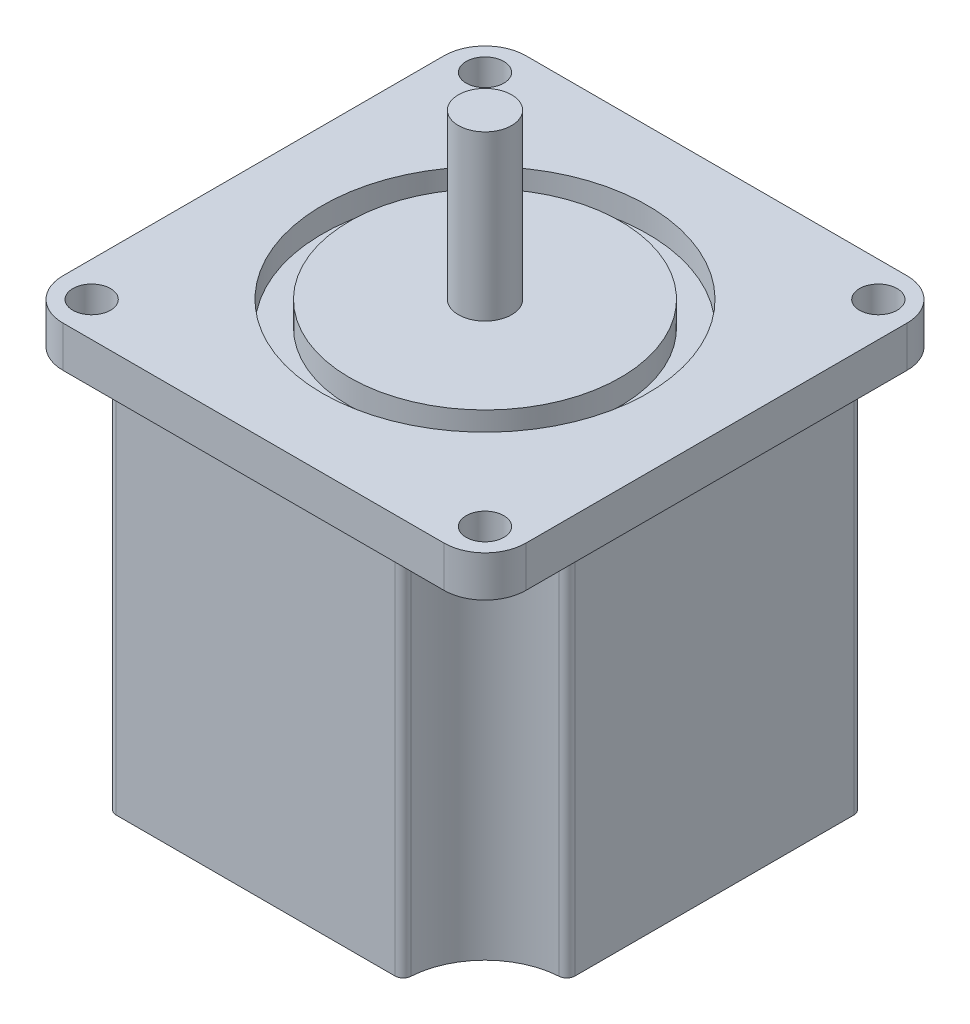
ISO-10303-21;
HEADER;
FILE_DESCRIPTION(('STEP AP214'),'2;1');
FILE_NAME('part.step','',(''),(''),'','','');
FILE_SCHEMA(('AUTOMOTIVE_DESIGN { 1 0 10303 214 1 1 1 1 }'));
ENDSEC;
DATA;
#1=APPLICATION_CONTEXT('core data for automotive mechanical design processes');
#2=APPLICATION_PROTOCOL_DEFINITION('international standard','automotive_design',2000,#1);
#3=PRODUCT_CONTEXT('',#1,'mechanical');
#4=PRODUCT('Part','Part','',(#3));
#5=PRODUCT_RELATED_PRODUCT_CATEGORY('part','',(#4));
#6=PRODUCT_DEFINITION_FORMATION('','',#4);
#7=PRODUCT_DEFINITION_CONTEXT('part definition',#1,'design');
#8=PRODUCT_DEFINITION('design','',#6,#7);
#9=PRODUCT_DEFINITION_SHAPE('','',#8);
#10=(LENGTH_UNIT() NAMED_UNIT(*) SI_UNIT(.MILLI.,.METRE.));
#11=(NAMED_UNIT(*) PLANE_ANGLE_UNIT() SI_UNIT($,.RADIAN.));
#12=(NAMED_UNIT(*) SI_UNIT($,.STERADIAN.) SOLID_ANGLE_UNIT());
#13=UNCERTAINTY_MEASURE_WITH_UNIT(LENGTH_MEASURE(1.E-05),#10,'distance_accuracy_value','');
#14=(GEOMETRIC_REPRESENTATION_CONTEXT(3) GLOBAL_UNCERTAINTY_ASSIGNED_CONTEXT((#13)) GLOBAL_UNIT_ASSIGNED_CONTEXT((#10,
#11,#12)) REPRESENTATION_CONTEXT('',''));
#15=CARTESIAN_POINT('',(0.,0.,0.));
#16=DIRECTION('',(0.,0.,1.));
#17=DIRECTION('',(1.,0.,0.));
#18=AXIS2_PLACEMENT_3D('',#15,#16,#17);
#19=CARTESIAN_POINT('',(0.,0.,0.));
#20=DIRECTION('',(0.,1.,0.));
#21=DIRECTION('',(0.,0.,1.));
#22=AXIS2_PLACEMENT_3D('',#19,#20,#21);
#23=PLANE('',#22);
#24=CARTESIAN_POINT('',(-27.6799104985517,0.,-27.6799104985517));
#25=DIRECTION('',(0.,1.,0.));
#26=DIRECTION('',(0.,0.,1.));
#27=AXIS2_PLACEMENT_3D('',#24,#25,#26);
#28=CIRCLE('',#27,9.68520131690144);
#29=CARTESIAN_POINT('',(-27.0636310424471,0.,-18.0143363210446));
#30=VERTEX_POINT('',#29);
#31=CARTESIAN_POINT('',(-18.0143363210446,0.,-27.0636310424471));
#32=VERTEX_POINT('',#31);
#33=EDGE_CURVE('E204',#30,#32,#28,.T.);
#34=ORIENTED_EDGE('',*,*,#33,.T.);
#35=CARTESIAN_POINT('',(-17.0163628291937,0.,-27.));
#36=DIRECTION('',(0.,1.,0.));
#37=DIRECTION('',(0.,0.,1.));
#38=AXIS2_PLACEMENT_3D('',#35,#36,#37);
#39=CIRCLE('',#38,1.);
#40=CARTESIAN_POINT('',(-17.0163628291937,0.,-28.));
#41=VERTEX_POINT('',#40);
#42=EDGE_CURVE('E248',#32,#41,#39,.F.);
#43=ORIENTED_EDGE('',*,*,#42,.T.);
#44=DIRECTION('',(-1.,0.,0.));
#45=VECTOR('',#44,1.);
#46=CARTESIAN_POINT('',(-28.,0.,-28.));
#47=LINE('',#46,#45);
#48=CARTESIAN_POINT('',(17.0163628291937,0.,-28.));
#49=VERTEX_POINT('',#48);
#50=EDGE_CURVE('E366',#49,#41,#47,.T.);
#51=ORIENTED_EDGE('',*,*,#50,.F.);
#52=CARTESIAN_POINT('',(17.0163628291937,0.,-27.));
#53=DIRECTION('',(0.,1.,0.));
#54=DIRECTION('',(0.,0.,1.));
#55=AXIS2_PLACEMENT_3D('',#52,#53,#54);
#56=CIRCLE('',#55,1.);
#57=CARTESIAN_POINT('',(18.0143363210446,0.,-27.0636310424471));
#58=VERTEX_POINT('',#57);
#59=EDGE_CURVE('E246',#49,#58,#56,.F.);
#60=ORIENTED_EDGE('',*,*,#59,.T.);
#61=CARTESIAN_POINT('',(27.6799104985517,0.,-27.6799104985517));
#62=DIRECTION('',(0.,-1.,0.));
#63=DIRECTION('',(0.,0.,1.));
#64=AXIS2_PLACEMENT_3D('',#61,#62,#63);
#65=CIRCLE('',#64,9.68520131690144);
#66=CARTESIAN_POINT('',(27.0636310424471,0.,-18.0143363210446));
#67=VERTEX_POINT('',#66);
#68=EDGE_CURVE('E398',#67,#58,#65,.T.);
#69=ORIENTED_EDGE('',*,*,#68,.F.);
#70=CARTESIAN_POINT('',(27.,0.,-17.0163628291937));
#71=DIRECTION('',(0.,1.,0.));
#72=DIRECTION('',(0.,0.,1.));
#73=AXIS2_PLACEMENT_3D('',#70,#71,#72);
#74=CIRCLE('',#73,1.);
#75=CARTESIAN_POINT('',(28.,0.,-17.0163628291937));
#76=VERTEX_POINT('',#75);
#77=EDGE_CURVE('E244',#67,#76,#74,.F.);
#78=ORIENTED_EDGE('',*,*,#77,.T.);
#79=DIRECTION('',(0.,0.,-1.));
#80=VECTOR('',#79,1.);
#81=CARTESIAN_POINT('',(28.,0.,-28.));
#82=LINE('',#81,#80);
#83=CARTESIAN_POINT('',(28.,0.,17.0163628291936));
#84=VERTEX_POINT('',#83);
#85=EDGE_CURVE('E363',#84,#76,#82,.T.);
#86=ORIENTED_EDGE('',*,*,#85,.F.);
#87=CARTESIAN_POINT('',(27.,0.,17.0163628291937));
#88=DIRECTION('',(0.,1.,0.));
#89=DIRECTION('',(0.,0.,1.));
#90=AXIS2_PLACEMENT_3D('',#87,#88,#89);
#91=CIRCLE('',#90,1.);
#92=CARTESIAN_POINT('',(27.0636310424471,0.,18.0143363210446));
#93=VERTEX_POINT('',#92);
#94=EDGE_CURVE('E242',#84,#93,#91,.F.);
#95=ORIENTED_EDGE('',*,*,#94,.T.);
#96=CARTESIAN_POINT('',(27.6799104985517,0.,27.6799104985517));
#97=DIRECTION('',(0.,1.,0.));
#98=DIRECTION('',(0.,0.,-1.));
#99=AXIS2_PLACEMENT_3D('',#96,#97,#98);
#100=CIRCLE('',#99,9.68520131690144);
#101=CARTESIAN_POINT('',(18.0143363210446,0.,27.0636310424471));
#102=VERTEX_POINT('',#101);
#103=EDGE_CURVE('E391',#93,#102,#100,.T.);
#104=ORIENTED_EDGE('',*,*,#103,.T.);
#105=CARTESIAN_POINT('',(17.0163628291937,0.,27.));
#106=DIRECTION('',(0.,1.,0.));
#107=DIRECTION('',(0.,0.,1.));
#108=AXIS2_PLACEMENT_3D('',#105,#106,#107);
#109=CIRCLE('',#108,1.);
#110=CARTESIAN_POINT('',(17.0163628291937,0.,28.));
#111=VERTEX_POINT('',#110);
#112=EDGE_CURVE('E211',#102,#111,#109,.F.);
#113=ORIENTED_EDGE('',*,*,#112,.T.);
#114=DIRECTION('',(1.,0.,0.));
#115=VECTOR('',#114,1.);
#116=CARTESIAN_POINT('',(-28.,0.,28.));
#117=LINE('',#116,#115);
#118=CARTESIAN_POINT('',(-17.0163628291937,0.,28.));
#119=VERTEX_POINT('',#118);
#120=EDGE_CURVE('E236',#119,#111,#117,.T.);
#121=ORIENTED_EDGE('',*,*,#120,.F.);
#122=CARTESIAN_POINT('',(-17.0163628291937,0.,27.));
#123=DIRECTION('',(0.,1.,0.));
#124=DIRECTION('',(0.,0.,1.));
#125=AXIS2_PLACEMENT_3D('',#122,#123,#124);
#126=CIRCLE('',#125,1.);
#127=CARTESIAN_POINT('',(-18.0143363210446,0.,27.0636310424471));
#128=VERTEX_POINT('',#127);
#129=EDGE_CURVE('E230',#119,#128,#126,.F.);
#130=ORIENTED_EDGE('',*,*,#129,.T.);
#131=CARTESIAN_POINT('',(-27.6799104985517,0.,27.6799104985517));
#132=DIRECTION('',(0.,-1.,0.));
#133=DIRECTION('',(0.,0.,-1.));
#134=AXIS2_PLACEMENT_3D('',#131,#132,#133);
#135=CIRCLE('',#134,9.68520131690144);
#136=CARTESIAN_POINT('',(-27.0636310424471,0.,18.0143363210446));
#137=VERTEX_POINT('',#136);
#138=EDGE_CURVE('E407',#137,#128,#135,.T.);
#139=ORIENTED_EDGE('',*,*,#138,.F.);
#140=CARTESIAN_POINT('',(-27.,0.,17.0163628291937));
#141=DIRECTION('',(0.,1.,0.));
#142=DIRECTION('',(0.,0.,1.));
#143=AXIS2_PLACEMENT_3D('',#140,#141,#142);
#144=CIRCLE('',#143,1.);
#145=CARTESIAN_POINT('',(-28.,0.,17.0163628291936));
#146=VERTEX_POINT('',#145);
#147=EDGE_CURVE('E212',#137,#146,#144,.F.);
#148=ORIENTED_EDGE('',*,*,#147,.T.);
#149=DIRECTION('',(0.,0.,1.));
#150=VECTOR('',#149,1.);
#151=CARTESIAN_POINT('',(-28.,0.,-28.));
#152=LINE('',#151,#150);
#153=CARTESIAN_POINT('',(-28.,0.,-17.0163628291937));
#154=VERTEX_POINT('',#153);
#155=EDGE_CURVE('E206',#154,#146,#152,.T.);
#156=ORIENTED_EDGE('',*,*,#155,.F.);
#157=CARTESIAN_POINT('',(-27.,0.,-17.0163628291937));
#158=DIRECTION('',(0.,1.,0.));
#159=DIRECTION('',(0.,0.,1.));
#160=AXIS2_PLACEMENT_3D('',#157,#158,#159);
#161=CIRCLE('',#160,1.);
#162=EDGE_CURVE('E202',#154,#30,#161,.F.);
#163=ORIENTED_EDGE('',*,*,#162,.T.);
#164=EDGE_LOOP('',(#34,#43,#51,#60,#69,#78,#86,#95,#104,#113,#121,#130,#139,#148,#156,#163));
#165=FACE_BOUND('',#164,.T.);
#166=ADVANCED_FACE('F41',(#165),#23,.F.);
#167=CARTESIAN_POINT('',(28.,44.,-28.));
#168=DIRECTION('',(-1.,0.,0.));
#169=DIRECTION('',(0.,0.,1.));
#170=AXIS2_PLACEMENT_3D('',#167,#168,#169);
#171=PLANE('',#170);
#172=ORIENTED_EDGE('',*,*,#85,.T.);
#173=DIRECTION('',(0.,-1.,0.));
#174=VECTOR('',#173,1.);
#175=CARTESIAN_POINT('',(28.,44.,-17.0163628291937));
#176=LINE('',#175,#174);
#177=CARTESIAN_POINT('',(28.,44.,-17.0163628291937));
#178=VERTEX_POINT('',#177);
#179=EDGE_CURVE('E263',#76,#178,#176,.F.);
#180=ORIENTED_EDGE('',*,*,#179,.T.);
#181=DIRECTION('',(0.,0.,-1.));
#182=VECTOR('',#181,1.);
#183=CARTESIAN_POINT('',(28.,44.,-28.));
#184=LINE('',#183,#182);
#185=CARTESIAN_POINT('',(28.,44.,17.0163628291936));
#186=VERTEX_POINT('',#185);
#187=EDGE_CURVE('E352',#186,#178,#184,.T.);
#188=ORIENTED_EDGE('',*,*,#187,.F.);
#189=DIRECTION('',(0.,1.,0.));
#190=VECTOR('',#189,1.);
#191=CARTESIAN_POINT('',(28.,0.,17.0163628291937));
#192=LINE('',#191,#190);
#193=EDGE_CURVE('E260',#186,#84,#192,.F.);
#194=ORIENTED_EDGE('',*,*,#193,.T.);
#195=EDGE_LOOP('',(#172,#180,#188,#194));
#196=FACE_BOUND('',#195,.T.);
#197=ADVANCED_FACE('F474',(#196),#171,.F.);
#198=CARTESIAN_POINT('',(-28.,44.,28.));
#199=DIRECTION('',(0.,0.,-1.));
#200=DIRECTION('',(-1.,0.,0.));
#201=AXIS2_PLACEMENT_3D('',#198,#199,#200);
#202=PLANE('',#201);
#203=ORIENTED_EDGE('',*,*,#120,.T.);
#204=DIRECTION('',(0.,1.,0.));
#205=VECTOR('',#204,1.);
#206=CARTESIAN_POINT('',(17.0163628291937,44.,28.));
#207=LINE('',#206,#205);
#208=CARTESIAN_POINT('',(17.0163628291937,44.,28.));
#209=VERTEX_POINT('',#208);
#210=EDGE_CURVE('E273',#111,#209,#207,.T.);
#211=ORIENTED_EDGE('',*,*,#210,.T.);
#212=DIRECTION('',(1.,0.,0.));
#213=VECTOR('',#212,1.);
#214=CARTESIAN_POINT('',(-28.,44.,28.));
#215=LINE('',#214,#213);
#216=CARTESIAN_POINT('',(-17.0163628291937,44.,28.));
#217=VERTEX_POINT('',#216);
#218=EDGE_CURVE('E233',#217,#209,#215,.T.);
#219=ORIENTED_EDGE('',*,*,#218,.F.);
#220=DIRECTION('',(0.,-1.,0.));
#221=VECTOR('',#220,1.);
#222=CARTESIAN_POINT('',(-17.0163628291937,44.,28.));
#223=LINE('',#222,#221);
#224=EDGE_CURVE('E270',#217,#119,#223,.T.);
#225=ORIENTED_EDGE('',*,*,#224,.T.);
#226=EDGE_LOOP('',(#203,#211,#219,#225));
#227=FACE_BOUND('',#226,.T.);
#228=ADVANCED_FACE('F374',(#227),#202,.F.);
#229=CARTESIAN_POINT('',(-28.,44.,-28.));
#230=DIRECTION('',(0.,0.,1.));
#231=DIRECTION('',(1.,0.,0.));
#232=AXIS2_PLACEMENT_3D('',#229,#230,#231);
#233=PLANE('',#232);
#234=ORIENTED_EDGE('',*,*,#50,.T.);
#235=DIRECTION('',(0.,1.,0.));
#236=VECTOR('',#235,1.);
#237=CARTESIAN_POINT('',(-17.0163628291937,44.,-28.));
#238=LINE('',#237,#236);
#239=CARTESIAN_POINT('',(-17.0163628291937,44.,-28.));
#240=VERTEX_POINT('',#239);
#241=EDGE_CURVE('E253',#41,#240,#238,.T.);
#242=ORIENTED_EDGE('',*,*,#241,.T.);
#243=DIRECTION('',(-1.,0.,0.));
#244=VECTOR('',#243,1.);
#245=CARTESIAN_POINT('',(-28.,44.,-28.));
#246=LINE('',#245,#244);
#247=CARTESIAN_POINT('',(17.0163628291937,44.,-28.));
#248=VERTEX_POINT('',#247);
#249=EDGE_CURVE('E355',#248,#240,#246,.T.);
#250=ORIENTED_EDGE('',*,*,#249,.F.);
#251=DIRECTION('',(0.,-1.,0.));
#252=VECTOR('',#251,1.);
#253=CARTESIAN_POINT('',(17.0163628291937,44.,-28.));
#254=LINE('',#253,#252);
#255=EDGE_CURVE('E250',#248,#49,#254,.T.);
#256=ORIENTED_EDGE('',*,*,#255,.T.);
#257=EDGE_LOOP('',(#234,#242,#250,#256));
#258=FACE_BOUND('',#257,.T.);
#259=ADVANCED_FACE('F487',(#258),#233,.F.);
#260=CARTESIAN_POINT('',(-28.,44.,-28.));
#261=DIRECTION('',(1.,0.,0.));
#262=DIRECTION('',(0.,0.,-1.));
#263=AXIS2_PLACEMENT_3D('',#260,#261,#262);
#264=PLANE('',#263);
#265=DIRECTION('',(0.,0.,1.));
#266=VECTOR('',#265,1.);
#267=CARTESIAN_POINT('',(-28.,44.,-28.));
#268=LINE('',#267,#266);
#269=CARTESIAN_POINT('',(-28.,44.,-17.0163628291937));
#270=VERTEX_POINT('',#269);
#271=CARTESIAN_POINT('',(-28.,44.,17.0163628291936));
#272=VERTEX_POINT('',#271);
#273=EDGE_CURVE('E358',#270,#272,#268,.T.);
#274=ORIENTED_EDGE('',*,*,#273,.F.);
#275=DIRECTION('',(0.,1.,0.));
#276=VECTOR('',#275,1.);
#277=CARTESIAN_POINT('',(-28.,0.,-17.0163628291937));
#278=LINE('',#277,#276);
#279=EDGE_CURVE('E277',#270,#154,#278,.F.);
#280=ORIENTED_EDGE('',*,*,#279,.T.);
#281=ORIENTED_EDGE('',*,*,#155,.T.);
#282=DIRECTION('',(0.,-1.,0.));
#283=VECTOR('',#282,1.);
#284=CARTESIAN_POINT('',(-28.,44.,17.0163628291937));
#285=LINE('',#284,#283);
#286=EDGE_CURVE('E275',#146,#272,#285,.F.);
#287=ORIENTED_EDGE('',*,*,#286,.T.);
#288=EDGE_LOOP('',(#274,#280,#281,#287));
#289=FACE_BOUND('',#288,.T.);
#290=ADVANCED_FACE('F488',(#289),#264,.F.);
#291=CARTESIAN_POINT('',(0.,44.,0.));
#292=DIRECTION('',(0.,1.,0.));
#293=DIRECTION('',(0.,0.,1.));
#294=AXIS2_PLACEMENT_3D('',#291,#292,#293);
#295=PLANE('',#294);
#296=CARTESIAN_POINT('',(27.6799104985517,44.,27.6799104985517));
#297=DIRECTION('',(0.,1.,0.));
#298=DIRECTION('',(0.,0.,-1.));
#299=AXIS2_PLACEMENT_3D('',#296,#297,#298);
#300=CIRCLE('',#299,9.68520131690144);
#301=CARTESIAN_POINT('',(27.0636310424471,44.,18.0143363210446));
#302=VERTEX_POINT('',#301);
#303=CARTESIAN_POINT('',(18.0143363210446,44.,27.0636310424471));
#304=VERTEX_POINT('',#303);
#305=EDGE_CURVE('E384',#302,#304,#300,.T.);
#306=ORIENTED_EDGE('',*,*,#305,.F.);
#307=CARTESIAN_POINT('',(27.,44.,17.0163628291937));
#308=DIRECTION('',(0.,1.,0.));
#309=DIRECTION('',(0.,0.,1.));
#310=AXIS2_PLACEMENT_3D('',#307,#308,#309);
#311=CIRCLE('',#310,1.);
#312=EDGE_CURVE('E290',#302,#186,#311,.T.);
#313=ORIENTED_EDGE('',*,*,#312,.T.);
#314=ORIENTED_EDGE('',*,*,#187,.T.);
#315=CARTESIAN_POINT('',(27.,44.,-17.0163628291937));
#316=DIRECTION('',(0.,1.,0.));
#317=DIRECTION('',(0.,0.,1.));
#318=AXIS2_PLACEMENT_3D('',#315,#316,#317);
#319=CIRCLE('',#318,1.);
#320=CARTESIAN_POINT('',(27.0636310424471,44.,-18.0143363210446));
#321=VERTEX_POINT('',#320);
#322=EDGE_CURVE('E288',#178,#321,#319,.T.);
#323=ORIENTED_EDGE('',*,*,#322,.T.);
#324=CARTESIAN_POINT('',(27.6799104985517,44.,-27.6799104985517));
#325=DIRECTION('',(0.,-1.,0.));
#326=DIRECTION('',(0.,0.,1.));
#327=AXIS2_PLACEMENT_3D('',#324,#325,#326);
#328=CIRCLE('',#327,9.68520131690144);
#329=CARTESIAN_POINT('',(18.0143363210446,44.,-27.0636310424471));
#330=VERTEX_POINT('',#329);
#331=EDGE_CURVE('E439',#321,#330,#328,.T.);
#332=ORIENTED_EDGE('',*,*,#331,.T.);
#333=CARTESIAN_POINT('',(17.0163628291937,44.,-27.));
#334=DIRECTION('',(0.,1.,0.));
#335=DIRECTION('',(0.,0.,1.));
#336=AXIS2_PLACEMENT_3D('',#333,#334,#335);
#337=CIRCLE('',#336,1.);
#338=EDGE_CURVE('E286',#330,#248,#337,.T.);
#339=ORIENTED_EDGE('',*,*,#338,.T.);
#340=ORIENTED_EDGE('',*,*,#249,.T.);
#341=CARTESIAN_POINT('',(-17.0163628291937,44.,-27.));
#342=DIRECTION('',(0.,1.,0.));
#343=DIRECTION('',(0.,0.,1.));
#344=AXIS2_PLACEMENT_3D('',#341,#342,#343);
#345=CIRCLE('',#344,1.);
#346=CARTESIAN_POINT('',(-18.0143363210446,44.,-27.0636310424471));
#347=VERTEX_POINT('',#346);
#348=EDGE_CURVE('E284',#240,#347,#345,.T.);
#349=ORIENTED_EDGE('',*,*,#348,.T.);
#350=CARTESIAN_POINT('',(-27.6799104985517,44.,-27.6799104985517));
#351=DIRECTION('',(0.,1.,0.));
#352=DIRECTION('',(0.,0.,1.));
#353=AXIS2_PLACEMENT_3D('',#350,#351,#352);
#354=CIRCLE('',#353,9.68520131690144);
#355=CARTESIAN_POINT('',(-27.0636310424471,44.,-18.0143363210446));
#356=VERTEX_POINT('',#355);
#357=EDGE_CURVE('E222',#356,#347,#354,.T.);
#358=ORIENTED_EDGE('',*,*,#357,.F.);
#359=CARTESIAN_POINT('',(-27.,44.,-17.0163628291937));
#360=DIRECTION('',(0.,1.,0.));
#361=DIRECTION('',(0.,0.,1.));
#362=AXIS2_PLACEMENT_3D('',#359,#360,#361);
#363=CIRCLE('',#362,1.);
#364=EDGE_CURVE('E227',#356,#270,#363,.T.);
#365=ORIENTED_EDGE('',*,*,#364,.T.);
#366=ORIENTED_EDGE('',*,*,#273,.T.);
#367=CARTESIAN_POINT('',(-27.,44.,17.0163628291937));
#368=DIRECTION('',(0.,1.,0.));
#369=DIRECTION('',(0.,0.,1.));
#370=AXIS2_PLACEMENT_3D('',#367,#368,#369);
#371=CIRCLE('',#370,1.);
#372=CARTESIAN_POINT('',(-27.0636310424471,44.,18.0143363210446));
#373=VERTEX_POINT('',#372);
#374=EDGE_CURVE('E295',#272,#373,#371,.T.);
#375=ORIENTED_EDGE('',*,*,#374,.T.);
#376=CARTESIAN_POINT('',(-27.6799104985517,44.,27.6799104985517));
#377=DIRECTION('',(0.,-1.,0.));
#378=DIRECTION('',(0.,0.,-1.));
#379=AXIS2_PLACEMENT_3D('',#376,#377,#378);
#380=CIRCLE('',#379,9.68520131690144);
#381=CARTESIAN_POINT('',(-18.0143363210446,44.,27.0636310424471));
#382=VERTEX_POINT('',#381);
#383=EDGE_CURVE('E403',#373,#382,#380,.T.);
#384=ORIENTED_EDGE('',*,*,#383,.T.);
#385=CARTESIAN_POINT('',(-17.0163628291937,44.,27.));
#386=DIRECTION('',(0.,1.,0.));
#387=DIRECTION('',(0.,0.,1.));
#388=AXIS2_PLACEMENT_3D('',#385,#386,#387);
#389=CIRCLE('',#388,1.);
#390=EDGE_CURVE('E297',#382,#217,#389,.T.);
#391=ORIENTED_EDGE('',*,*,#390,.T.);
#392=ORIENTED_EDGE('',*,*,#218,.T.);
#393=CARTESIAN_POINT('',(17.0163628291937,44.,27.));
#394=DIRECTION('',(0.,1.,0.));
#395=DIRECTION('',(0.,0.,1.));
#396=AXIS2_PLACEMENT_3D('',#393,#394,#395);
#397=CIRCLE('',#396,1.);
#398=EDGE_CURVE('E292',#209,#304,#397,.T.);
#399=ORIENTED_EDGE('',*,*,#398,.T.);
#400=EDGE_LOOP('',(#306,#313,#314,#323,#332,#339,#340,#349,#358,#365,#366,#375,#384,#391,#392,#399));
#401=FACE_BOUND('',#400,.T.);
#402=DIRECTION('',(-1.,0.,0.));
#403=VECTOR('',#402,1.);
#404=CARTESIAN_POINT('',(-28.25,44.,-28.25));
#405=LINE('',#404,#403);
#406=CARTESIAN_POINT('',(23.25,44.,-28.25));
#407=VERTEX_POINT('',#406);
#408=CARTESIAN_POINT('',(-23.25,44.,-28.25));
#409=VERTEX_POINT('',#408);
#410=EDGE_CURVE('E348',#407,#409,#405,.T.);
#411=ORIENTED_EDGE('',*,*,#410,.F.);
#412=CARTESIAN_POINT('',(23.25,44.,-23.25));
#413=DIRECTION('',(0.,1.,0.));
#414=DIRECTION('',(0.,0.,1.));
#415=AXIS2_PLACEMENT_3D('',#412,#413,#414);
#416=CIRCLE('',#415,5.);
#417=CARTESIAN_POINT('',(28.25,44.,-23.25));
#418=VERTEX_POINT('',#417);
#419=EDGE_CURVE('E310',#407,#418,#416,.F.);
#420=ORIENTED_EDGE('',*,*,#419,.T.);
#421=DIRECTION('',(0.,0.,-1.));
#422=VECTOR('',#421,1.);
#423=CARTESIAN_POINT('',(28.25,44.,-28.25));
#424=LINE('',#423,#422);
#425=CARTESIAN_POINT('',(28.25,44.,23.25));
#426=VERTEX_POINT('',#425);
#427=EDGE_CURVE('E442',#426,#418,#424,.T.);
#428=ORIENTED_EDGE('',*,*,#427,.F.);
#429=CARTESIAN_POINT('',(23.25,44.,23.25));
#430=DIRECTION('',(0.,1.,0.));
#431=DIRECTION('',(0.,0.,1.));
#432=AXIS2_PLACEMENT_3D('',#429,#430,#431);
#433=CIRCLE('',#432,5.);
#434=CARTESIAN_POINT('',(23.25,44.,28.25));
#435=VERTEX_POINT('',#434);
#436=EDGE_CURVE('E306',#426,#435,#433,.F.);
#437=ORIENTED_EDGE('',*,*,#436,.T.);
#438=DIRECTION('',(1.,0.,0.));
#439=VECTOR('',#438,1.);
#440=CARTESIAN_POINT('',(-28.25,44.,28.25));
#441=LINE('',#440,#439);
#442=CARTESIAN_POINT('',(-23.25,44.,28.25));
#443=VERTEX_POINT('',#442);
#444=EDGE_CURVE('E332',#443,#435,#441,.T.);
#445=ORIENTED_EDGE('',*,*,#444,.F.);
#446=CARTESIAN_POINT('',(-23.25,44.,23.25));
#447=DIRECTION('',(0.,1.,0.));
#448=DIRECTION('',(0.,0.,1.));
#449=AXIS2_PLACEMENT_3D('',#446,#447,#448);
#450=CIRCLE('',#449,5.);
#451=CARTESIAN_POINT('',(-28.25,44.,23.25));
#452=VERTEX_POINT('',#451);
#453=EDGE_CURVE('E304',#443,#452,#450,.F.);
#454=ORIENTED_EDGE('',*,*,#453,.T.);
#455=DIRECTION('',(0.,0.,1.));
#456=VECTOR('',#455,1.);
#457=CARTESIAN_POINT('',(-28.25,44.,-28.25));
#458=LINE('',#457,#456);
#459=CARTESIAN_POINT('',(-28.25,44.,-23.25));
#460=VERTEX_POINT('',#459);
#461=EDGE_CURVE('E343',#460,#452,#458,.T.);
#462=ORIENTED_EDGE('',*,*,#461,.F.);
#463=CARTESIAN_POINT('',(-23.25,44.,-23.25));
#464=DIRECTION('',(0.,1.,0.));
#465=DIRECTION('',(0.,0.,1.));
#466=AXIS2_PLACEMENT_3D('',#463,#464,#465);
#467=CIRCLE('',#466,5.);
#468=EDGE_CURVE('E308',#460,#409,#467,.F.);
#469=ORIENTED_EDGE('',*,*,#468,.T.);
#470=EDGE_LOOP('',(#411,#420,#428,#437,#445,#454,#462,#469));
#471=FACE_BOUND('',#470,.T.);
#472=CARTESIAN_POINT('',(-24.,44.,24.));
#473=DIRECTION('',(0.,1.,0.));
#474=DIRECTION('',(0.,0.,1.));
#475=AXIS2_PLACEMENT_3D('',#472,#473,#474);
#476=CIRCLE('',#475,2.3);
#477=CARTESIAN_POINT('',(-24.,44.,26.3));
#478=VERTEX_POINT('',#477);
#479=EDGE_CURVE('E406',#478,#478,#476,.T.);
#480=ORIENTED_EDGE('',*,*,#479,.T.);
#481=EDGE_LOOP('',(#480));
#482=FACE_BOUND('',#481,.T.);
#483=CARTESIAN_POINT('',(-24.,44.,-24.));
#484=DIRECTION('',(0.,1.,0.));
#485=DIRECTION('',(0.,0.,1.));
#486=AXIS2_PLACEMENT_3D('',#483,#484,#485);
#487=CIRCLE('',#486,2.3);
#488=CARTESIAN_POINT('',(-24.,44.,-21.7));
#489=VERTEX_POINT('',#488);
#490=EDGE_CURVE('E401',#489,#489,#487,.T.);
#491=ORIENTED_EDGE('',*,*,#490,.T.);
#492=EDGE_LOOP('',(#491));
#493=FACE_BOUND('',#492,.T.);
#494=CARTESIAN_POINT('',(24.,44.,24.));
#495=DIRECTION('',(0.,1.,0.));
#496=DIRECTION('',(0.,0.,1.));
#497=AXIS2_PLACEMENT_3D('',#494,#495,#496);
#498=CIRCLE('',#497,2.3);
#499=CARTESIAN_POINT('',(24.,44.,26.3));
#500=VERTEX_POINT('',#499);
#501=EDGE_CURVE('E223',#500,#500,#498,.T.);
#502=ORIENTED_EDGE('',*,*,#501,.T.);
#503=EDGE_LOOP('',(#502));
#504=FACE_BOUND('',#503,.T.);
#505=CARTESIAN_POINT('',(24.,44.,-24.));
#506=DIRECTION('',(0.,1.,0.));
#507=DIRECTION('',(0.,0.,1.));
#508=AXIS2_PLACEMENT_3D('',#505,#506,#507);
#509=CIRCLE('',#508,2.3);
#510=CARTESIAN_POINT('',(24.,44.,-21.7));
#511=VERTEX_POINT('',#510);
#512=EDGE_CURVE('E395',#511,#511,#509,.T.);
#513=ORIENTED_EDGE('',*,*,#512,.T.);
#514=EDGE_LOOP('',(#513));
#515=FACE_BOUND('',#514,.T.);
#516=ADVANCED_FACE('F337',(#401,#471,#482,#493,#504,#515),#295,.F.);
#517=CARTESIAN_POINT('',(0.,49.,0.));
#518=DIRECTION('',(0.,1.,0.));
#519=DIRECTION('',(0.,0.,1.));
#520=AXIS2_PLACEMENT_3D('',#517,#518,#519);
#521=PLANE('',#520);
#522=CARTESIAN_POINT('',(0.,49.,0.));
#523=DIRECTION('',(0.,1.,0.));
#524=DIRECTION('',(0.,0.,1.));
#525=AXIS2_PLACEMENT_3D('',#522,#523,#524);
#526=CIRCLE('',#525,19.8517317107256);
#527=CARTESIAN_POINT('',(0.,49.,19.8517317107256));
#528=VERTEX_POINT('',#527);
#529=EDGE_CURVE('E417',#528,#528,#526,.T.);
#530=ORIENTED_EDGE('',*,*,#529,.F.);
#531=EDGE_LOOP('',(#530));
#532=FACE_BOUND('',#531,.T.);
#533=CARTESIAN_POINT('',(-24.,49.,24.));
#534=DIRECTION('',(0.,1.,0.));
#535=DIRECTION('',(0.,0.,1.));
#536=AXIS2_PLACEMENT_3D('',#533,#534,#535);
#537=CIRCLE('',#536,2.3);
#538=CARTESIAN_POINT('',(-24.,49.,26.3));
#539=VERTEX_POINT('',#538);
#540=EDGE_CURVE('E427',#539,#539,#537,.T.);
#541=ORIENTED_EDGE('',*,*,#540,.F.);
#542=EDGE_LOOP('',(#541));
#543=FACE_BOUND('',#542,.T.);
#544=CARTESIAN_POINT('',(-24.,49.,-24.));
#545=DIRECTION('',(0.,1.,0.));
#546=DIRECTION('',(0.,0.,1.));
#547=AXIS2_PLACEMENT_3D('',#544,#545,#546);
#548=CIRCLE('',#547,2.3);
#549=CARTESIAN_POINT('',(-24.,49.,-21.7));
#550=VERTEX_POINT('',#549);
#551=EDGE_CURVE('E436',#550,#550,#548,.T.);
#552=ORIENTED_EDGE('',*,*,#551,.F.);
#553=EDGE_LOOP('',(#552));
#554=FACE_BOUND('',#553,.T.);
#555=DIRECTION('',(0.,0.,-1.));
#556=VECTOR('',#555,1.);
#557=CARTESIAN_POINT('',(28.25,49.,-28.25));
#558=LINE('',#557,#556);
#559=CARTESIAN_POINT('',(28.25,49.,23.25));
#560=VERTEX_POINT('',#559);
#561=CARTESIAN_POINT('',(28.25,49.,-23.25));
#562=VERTEX_POINT('',#561);
#563=EDGE_CURVE('E342',#560,#562,#558,.T.);
#564=ORIENTED_EDGE('',*,*,#563,.T.);
#565=CARTESIAN_POINT('',(23.25,49.,-23.25));
#566=DIRECTION('',(0.,1.,0.));
#567=DIRECTION('',(0.,0.,1.));
#568=AXIS2_PLACEMENT_3D('',#565,#566,#567);
#569=CIRCLE('',#568,5.);
#570=CARTESIAN_POINT('',(23.25,49.,-28.25));
#571=VERTEX_POINT('',#570);
#572=EDGE_CURVE('E322',#562,#571,#569,.T.);
#573=ORIENTED_EDGE('',*,*,#572,.T.);
#574=DIRECTION('',(-1.,0.,0.));
#575=VECTOR('',#574,1.);
#576=CARTESIAN_POINT('',(-28.25,49.,-28.25));
#577=LINE('',#576,#575);
#578=CARTESIAN_POINT('',(-23.25,49.,-28.25));
#579=VERTEX_POINT('',#578);
#580=EDGE_CURVE('E346',#571,#579,#577,.T.);
#581=ORIENTED_EDGE('',*,*,#580,.T.);
#582=CARTESIAN_POINT('',(-23.25,49.,-23.25));
#583=DIRECTION('',(0.,1.,0.));
#584=DIRECTION('',(0.,0.,1.));
#585=AXIS2_PLACEMENT_3D('',#582,#583,#584);
#586=CIRCLE('',#585,5.);
#587=CARTESIAN_POINT('',(-28.25,49.,-23.25));
#588=VERTEX_POINT('',#587);
#589=EDGE_CURVE('E320',#579,#588,#586,.T.);
#590=ORIENTED_EDGE('',*,*,#589,.T.);
#591=DIRECTION('',(0.,0.,1.));
#592=VECTOR('',#591,1.);
#593=CARTESIAN_POINT('',(-28.25,49.,-28.25));
#594=LINE('',#593,#592);
#595=CARTESIAN_POINT('',(-28.25,49.,23.25));
#596=VERTEX_POINT('',#595);
#597=EDGE_CURVE('E447',#588,#596,#594,.T.);
#598=ORIENTED_EDGE('',*,*,#597,.T.);
#599=CARTESIAN_POINT('',(-23.25,49.,23.25));
#600=DIRECTION('',(0.,1.,0.));
#601=DIRECTION('',(0.,0.,1.));
#602=AXIS2_PLACEMENT_3D('',#599,#600,#601);
#603=CIRCLE('',#602,5.);
#604=CARTESIAN_POINT('',(-23.25,49.,28.25));
#605=VERTEX_POINT('',#604);
#606=EDGE_CURVE('E61',#596,#605,#603,.T.);
#607=ORIENTED_EDGE('',*,*,#606,.T.);
#608=DIRECTION('',(1.,0.,0.));
#609=VECTOR('',#608,1.);
#610=CARTESIAN_POINT('',(-28.25,49.,28.25));
#611=LINE('',#610,#609);
#612=CARTESIAN_POINT('',(23.25,49.,28.25));
#613=VERTEX_POINT('',#612);
#614=EDGE_CURVE('E333',#605,#613,#611,.T.);
#615=ORIENTED_EDGE('',*,*,#614,.T.);
#616=CARTESIAN_POINT('',(23.25,49.,23.25));
#617=DIRECTION('',(0.,1.,0.));
#618=DIRECTION('',(0.,0.,1.));
#619=AXIS2_PLACEMENT_3D('',#616,#617,#618);
#620=CIRCLE('',#619,5.);
#621=EDGE_CURVE('E318',#613,#560,#620,.T.);
#622=ORIENTED_EDGE('',*,*,#621,.T.);
#623=EDGE_LOOP('',(#564,#573,#581,#590,#598,#607,#615,#622));
#624=FACE_BOUND('',#623,.T.);
#625=CARTESIAN_POINT('',(24.,49.,-24.));
#626=DIRECTION('',(0.,1.,0.));
#627=DIRECTION('',(0.,0.,1.));
#628=AXIS2_PLACEMENT_3D('',#625,#626,#627);
#629=CIRCLE('',#628,2.3);
#630=CARTESIAN_POINT('',(24.,49.,-21.7));
#631=VERTEX_POINT('',#630);
#632=EDGE_CURVE('E431',#631,#631,#629,.T.);
#633=ORIENTED_EDGE('',*,*,#632,.F.);
#634=EDGE_LOOP('',(#633));
#635=FACE_BOUND('',#634,.T.);
#636=CARTESIAN_POINT('',(24.,49.,24.));
#637=DIRECTION('',(0.,1.,0.));
#638=DIRECTION('',(0.,0.,1.));
#639=AXIS2_PLACEMENT_3D('',#636,#637,#638);
#640=CIRCLE('',#639,2.3);
#641=CARTESIAN_POINT('',(24.,49.,26.3));
#642=VERTEX_POINT('',#641);
#643=EDGE_CURVE('E423',#642,#642,#640,.T.);
#644=ORIENTED_EDGE('',*,*,#643,.F.);
#645=EDGE_LOOP('',(#644));
#646=FACE_BOUND('',#645,.T.);
#647=ADVANCED_FACE('F462',(#532,#543,#554,#624,#635,#646),#521,.T.);
#648=CARTESIAN_POINT('',(28.25,49.,-28.25));
#649=DIRECTION('',(-1.,0.,0.));
#650=DIRECTION('',(0.,0.,1.));
#651=AXIS2_PLACEMENT_3D('',#648,#649,#650);
#652=PLANE('',#651);
#653=ORIENTED_EDGE('',*,*,#427,.T.);
#654=DIRECTION('',(0.,-1.,0.));
#655=VECTOR('',#654,1.);
#656=CARTESIAN_POINT('',(28.25,49.,-23.25));
#657=LINE('',#656,#655);
#658=EDGE_CURVE('E315',#418,#562,#657,.F.);
#659=ORIENTED_EDGE('',*,*,#658,.T.);
#660=ORIENTED_EDGE('',*,*,#563,.F.);
#661=DIRECTION('',(0.,-1.,0.));
#662=VECTOR('',#661,1.);
#663=CARTESIAN_POINT('',(28.25,49.,23.25));
#664=LINE('',#663,#662);
#665=EDGE_CURVE('E312',#560,#426,#664,.T.);
#666=ORIENTED_EDGE('',*,*,#665,.T.);
#667=EDGE_LOOP('',(#653,#659,#660,#666));
#668=FACE_BOUND('',#667,.T.);
#669=ADVANCED_FACE('F483',(#668),#652,.F.);
#670=CARTESIAN_POINT('',(-28.25,49.,-28.25));
#671=DIRECTION('',(0.,0.,1.));
#672=DIRECTION('',(1.,0.,0.));
#673=AXIS2_PLACEMENT_3D('',#670,#671,#672);
#674=PLANE('',#673);
#675=ORIENTED_EDGE('',*,*,#580,.F.);
#676=DIRECTION('',(0.,-1.,0.));
#677=VECTOR('',#676,1.);
#678=CARTESIAN_POINT('',(23.25,49.,-28.25));
#679=LINE('',#678,#677);
#680=EDGE_CURVE('E301',#571,#407,#679,.T.);
#681=ORIENTED_EDGE('',*,*,#680,.T.);
#682=ORIENTED_EDGE('',*,*,#410,.T.);
#683=DIRECTION('',(0.,-1.,0.));
#684=VECTOR('',#683,1.);
#685=CARTESIAN_POINT('',(-23.25,49.,-28.25));
#686=LINE('',#685,#684);
#687=EDGE_CURVE('E299',#409,#579,#686,.F.);
#688=ORIENTED_EDGE('',*,*,#687,.T.);
#689=EDGE_LOOP('',(#675,#681,#682,#688));
#690=FACE_BOUND('',#689,.T.);
#691=ADVANCED_FACE('F455',(#690),#674,.F.);
#692=CARTESIAN_POINT('',(-28.25,49.,-28.25));
#693=DIRECTION('',(1.,0.,0.));
#694=DIRECTION('',(0.,0.,-1.));
#695=AXIS2_PLACEMENT_3D('',#692,#693,#694);
#696=PLANE('',#695);
#697=ORIENTED_EDGE('',*,*,#597,.F.);
#698=DIRECTION('',(0.,-1.,0.));
#699=VECTOR('',#698,1.);
#700=CARTESIAN_POINT('',(-28.25,49.,-23.25));
#701=LINE('',#700,#699);
#702=EDGE_CURVE('E326',#588,#460,#701,.T.);
#703=ORIENTED_EDGE('',*,*,#702,.T.);
#704=ORIENTED_EDGE('',*,*,#461,.T.);
#705=DIRECTION('',(0.,-1.,0.));
#706=VECTOR('',#705,1.);
#707=CARTESIAN_POINT('',(-28.25,49.,23.25));
#708=LINE('',#707,#706);
#709=EDGE_CURVE('E324',#452,#596,#708,.F.);
#710=ORIENTED_EDGE('',*,*,#709,.T.);
#711=EDGE_LOOP('',(#697,#703,#704,#710));
#712=FACE_BOUND('',#711,.T.);
#713=ADVANCED_FACE('F465',(#712),#696,.F.);
#714=CARTESIAN_POINT('',(-28.25,49.,28.25));
#715=DIRECTION('',(0.,0.,-1.));
#716=DIRECTION('',(-1.,0.,0.));
#717=AXIS2_PLACEMENT_3D('',#714,#715,#716);
#718=PLANE('',#717);
#719=ORIENTED_EDGE('',*,*,#444,.T.);
#720=DIRECTION('',(0.,-1.,0.));
#721=VECTOR('',#720,1.);
#722=CARTESIAN_POINT('',(23.25,49.,28.25));
#723=LINE('',#722,#721);
#724=EDGE_CURVE('E11',#435,#613,#723,.F.);
#725=ORIENTED_EDGE('',*,*,#724,.T.);
#726=ORIENTED_EDGE('',*,*,#614,.F.);
#727=DIRECTION('',(0.,-1.,0.));
#728=VECTOR('',#727,1.);
#729=CARTESIAN_POINT('',(-23.25,49.,28.25));
#730=LINE('',#729,#728);
#731=EDGE_CURVE('E49',#605,#443,#730,.T.);
#732=ORIENTED_EDGE('',*,*,#731,.T.);
#733=EDGE_LOOP('',(#719,#725,#726,#732));
#734=FACE_BOUND('',#733,.T.);
#735=ADVANCED_FACE('F331',(#734),#718,.F.);
#736=CARTESIAN_POINT('',(-24.,49.,-24.));
#737=DIRECTION('',(0.,-1.,0.));
#738=DIRECTION('',(0.,0.,-1.));
#739=AXIS2_PLACEMENT_3D('',#736,#737,#738);
#740=CYLINDRICAL_SURFACE('',#739,2.3);
#741=ORIENTED_EDGE('',*,*,#551,.T.);
#742=EDGE_LOOP('',(#741));
#743=FACE_BOUND('',#742,.T.);
#744=ORIENTED_EDGE('',*,*,#490,.F.);
#745=EDGE_LOOP('',(#744));
#746=FACE_BOUND('',#745,.T.);
#747=ADVANCED_FACE('F763',(#743,#746),#740,.F.);
#748=CARTESIAN_POINT('',(24.,49.,-24.));
#749=DIRECTION('',(0.,-1.,0.));
#750=DIRECTION('',(0.,0.,-1.));
#751=AXIS2_PLACEMENT_3D('',#748,#749,#750);
#752=CYLINDRICAL_SURFACE('',#751,2.3);
#753=ORIENTED_EDGE('',*,*,#632,.T.);
#754=EDGE_LOOP('',(#753));
#755=FACE_BOUND('',#754,.T.);
#756=ORIENTED_EDGE('',*,*,#512,.F.);
#757=EDGE_LOOP('',(#756));
#758=FACE_BOUND('',#757,.T.);
#759=ADVANCED_FACE('F753',(#755,#758),#752,.F.);
#760=CARTESIAN_POINT('',(-24.,49.,24.));
#761=DIRECTION('',(0.,-1.,0.));
#762=DIRECTION('',(0.,0.,-1.));
#763=AXIS2_PLACEMENT_3D('',#760,#761,#762);
#764=CYLINDRICAL_SURFACE('',#763,2.3);
#765=ORIENTED_EDGE('',*,*,#540,.T.);
#766=EDGE_LOOP('',(#765));
#767=FACE_BOUND('',#766,.T.);
#768=ORIENTED_EDGE('',*,*,#479,.F.);
#769=EDGE_LOOP('',(#768));
#770=FACE_BOUND('',#769,.T.);
#771=ADVANCED_FACE('F743',(#767,#770),#764,.F.);
#772=CARTESIAN_POINT('',(24.,49.,24.));
#773=DIRECTION('',(0.,-1.,0.));
#774=DIRECTION('',(0.,0.,-1.));
#775=AXIS2_PLACEMENT_3D('',#772,#773,#774);
#776=CYLINDRICAL_SURFACE('',#775,2.3);
#777=ORIENTED_EDGE('',*,*,#643,.T.);
#778=EDGE_LOOP('',(#777));
#779=FACE_BOUND('',#778,.T.);
#780=ORIENTED_EDGE('',*,*,#501,.F.);
#781=EDGE_LOOP('',(#780));
#782=FACE_BOUND('',#781,.T.);
#783=ADVANCED_FACE('F723',(#779,#782),#776,.F.);
#784=CARTESIAN_POINT('',(0.,46.,0.));
#785=DIRECTION('',(0.,1.,0.));
#786=DIRECTION('',(0.,0.,1.));
#787=AXIS2_PLACEMENT_3D('',#784,#785,#786);
#788=CYLINDRICAL_SURFACE('',#787,19.8517317107256);
#789=CARTESIAN_POINT('',(0.,46.,0.));
#790=DIRECTION('',(0.,1.,0.));
#791=DIRECTION('',(0.,0.,1.));
#792=AXIS2_PLACEMENT_3D('',#789,#790,#791);
#793=CIRCLE('',#792,19.8517317107256);
#794=CARTESIAN_POINT('',(0.,46.,19.8517317107256));
#795=VERTEX_POINT('',#794);
#796=EDGE_CURVE('E420',#795,#795,#793,.T.);
#797=ORIENTED_EDGE('',*,*,#796,.F.);
#798=EDGE_LOOP('',(#797));
#799=FACE_BOUND('',#798,.T.);
#800=ORIENTED_EDGE('',*,*,#529,.T.);
#801=EDGE_LOOP('',(#800));
#802=FACE_BOUND('',#801,.T.);
#803=ADVANCED_FACE('F713',(#799,#802),#788,.F.);
#804=CARTESIAN_POINT('',(0.,46.,0.));
#805=DIRECTION('',(0.,1.,0.));
#806=DIRECTION('',(0.,0.,1.));
#807=AXIS2_PLACEMENT_3D('',#804,#805,#806);
#808=PLANE('',#807);
#809=CARTESIAN_POINT('',(0.,46.,0.));
#810=DIRECTION('',(0.,1.,0.));
#811=DIRECTION('',(0.,0.,1.));
#812=AXIS2_PLACEMENT_3D('',#809,#810,#811);
#813=CIRCLE('',#812,16.5288823728851);
#814=CARTESIAN_POINT('',(0.,46.,16.5288823728851));
#815=VERTEX_POINT('',#814);
#816=EDGE_CURVE('E414',#815,#815,#813,.T.);
#817=ORIENTED_EDGE('',*,*,#816,.F.);
#818=EDGE_LOOP('',(#817));
#819=FACE_BOUND('',#818,.T.);
#820=ORIENTED_EDGE('',*,*,#796,.T.);
#821=EDGE_LOOP('',(#820));
#822=FACE_BOUND('',#821,.T.);
#823=ADVANCED_FACE('F703',(#819,#822),#808,.T.);
#824=CARTESIAN_POINT('',(0.,46.,0.));
#825=DIRECTION('',(0.,1.,0.));
#826=DIRECTION('',(0.,0.,1.));
#827=AXIS2_PLACEMENT_3D('',#824,#825,#826);
#828=CYLINDRICAL_SURFACE('',#827,16.5288823728851);
#829=ORIENTED_EDGE('',*,*,#816,.T.);
#830=EDGE_LOOP('',(#829));
#831=FACE_BOUND('',#830,.T.);
#832=CARTESIAN_POINT('',(0.,49.,0.));
#833=DIRECTION('',(0.,1.,0.));
#834=DIRECTION('',(0.,0.,1.));
#835=AXIS2_PLACEMENT_3D('',#832,#833,#834);
#836=CIRCLE('',#835,16.5288823728851);
#837=CARTESIAN_POINT('',(0.,49.,16.5288823728851));
#838=VERTEX_POINT('',#837);
#839=EDGE_CURVE('E412',#838,#838,#836,.T.);
#840=ORIENTED_EDGE('',*,*,#839,.F.);
#841=EDGE_LOOP('',(#840));
#842=FACE_BOUND('',#841,.T.);
#843=ADVANCED_FACE('F699',(#831,#842),#828,.T.);
#844=CARTESIAN_POINT('',(0.,49.,0.));
#845=DIRECTION('',(0.,1.,0.));
#846=DIRECTION('',(0.,0.,1.));
#847=AXIS2_PLACEMENT_3D('',#844,#845,#846);
#848=CIRCLE('',#847,3.25);
#849=CARTESIAN_POINT('',(0.,49.,3.25));
#850=VERTEX_POINT('',#849);
#851=EDGE_CURVE('E228',#850,#850,#848,.T.);
#852=ORIENTED_EDGE('',*,*,#851,.F.);
#853=EDGE_LOOP('',(#852));
#854=FACE_BOUND('',#853,.T.);
#855=ORIENTED_EDGE('',*,*,#839,.T.);
#856=EDGE_LOOP('',(#855));
#857=FACE_BOUND('',#856,.T.);
#858=ADVANCED_FACE('F692',(#854,#857),#521,.T.);
#859=CARTESIAN_POINT('',(0.,69.,0.));
#860=DIRECTION('',(0.,-1.,0.));
#861=DIRECTION('',(0.,0.,-1.));
#862=AXIS2_PLACEMENT_3D('',#859,#860,#861);
#863=CYLINDRICAL_SURFACE('',#862,3.25);
#864=CARTESIAN_POINT('',(0.,69.,0.));
#865=DIRECTION('',(0.,1.,0.));
#866=DIRECTION('',(0.,0.,1.));
#867=AXIS2_PLACEMENT_3D('',#864,#865,#866);
#868=CIRCLE('',#867,3.25);
#869=CARTESIAN_POINT('',(0.,69.,3.25));
#870=VERTEX_POINT('',#869);
#871=EDGE_CURVE('E410',#870,#870,#868,.T.);
#872=ORIENTED_EDGE('',*,*,#871,.F.);
#873=EDGE_LOOP('',(#872));
#874=FACE_BOUND('',#873,.T.);
#875=ORIENTED_EDGE('',*,*,#851,.T.);
#876=EDGE_LOOP('',(#875));
#877=FACE_BOUND('',#876,.T.);
#878=ADVANCED_FACE('F682',(#874,#877),#863,.T.);
#879=CARTESIAN_POINT('',(0.,69.,0.));
#880=DIRECTION('',(0.,1.,0.));
#881=DIRECTION('',(0.,0.,1.));
#882=AXIS2_PLACEMENT_3D('',#879,#880,#881);
#883=PLANE('',#882);
#884=ORIENTED_EDGE('',*,*,#871,.T.);
#885=EDGE_LOOP('',(#884));
#886=FACE_BOUND('',#885,.T.);
#887=ADVANCED_FACE('F672',(#886),#883,.T.);
#888=CARTESIAN_POINT('',(-27.6799104985517,44.,27.6799104985517));
#889=DIRECTION('',(0.,-1.,0.));
#890=DIRECTION('',(0.,0.,-1.));
#891=AXIS2_PLACEMENT_3D('',#888,#889,#890);
#892=CYLINDRICAL_SURFACE('',#891,9.68520131690144);
#893=ORIENTED_EDGE('',*,*,#383,.F.);
#894=DIRECTION('',(0.,-1.,0.));
#895=VECTOR('',#894,1.);
#896=CARTESIAN_POINT('',(-27.0636310424471,44.,18.0143363210446));
#897=LINE('',#896,#895);
#898=EDGE_CURVE('E281',#373,#137,#897,.T.);
#899=ORIENTED_EDGE('',*,*,#898,.T.);
#900=ORIENTED_EDGE('',*,*,#138,.T.);
#901=DIRECTION('',(0.,-1.,0.));
#902=VECTOR('',#901,1.);
#903=CARTESIAN_POINT('',(-18.0143363210446,44.,27.0636310424471));
#904=LINE('',#903,#902);
#905=EDGE_CURVE('E279',#128,#382,#904,.F.);
#906=ORIENTED_EDGE('',*,*,#905,.T.);
#907=EDGE_LOOP('',(#893,#899,#900,#906));
#908=FACE_BOUND('',#907,.T.);
#909=ADVANCED_FACE('F627',(#908),#892,.F.);
#910=CARTESIAN_POINT('',(-27.6799104985517,44.,-27.6799104985517));
#911=DIRECTION('',(0.,-1.,0.));
#912=DIRECTION('',(0.,0.,-1.));
#913=AXIS2_PLACEMENT_3D('',#910,#911,#912);
#914=CYLINDRICAL_SURFACE('',#913,9.68520131690144);
#915=ORIENTED_EDGE('',*,*,#357,.T.);
#916=DIRECTION('',(0.,-1.,0.));
#917=VECTOR('',#916,1.);
#918=CARTESIAN_POINT('',(-18.0143363210446,44.,-27.0636310424471));
#919=LINE('',#918,#917);
#920=EDGE_CURVE('E221',#347,#32,#919,.T.);
#921=ORIENTED_EDGE('',*,*,#920,.T.);
#922=ORIENTED_EDGE('',*,*,#33,.F.);
#923=DIRECTION('',(0.,-1.,0.));
#924=VECTOR('',#923,1.);
#925=CARTESIAN_POINT('',(-27.0636310424471,44.,-18.0143363210446));
#926=LINE('',#925,#924);
#927=EDGE_CURVE('E218',#30,#356,#926,.F.);
#928=ORIENTED_EDGE('',*,*,#927,.T.);
#929=EDGE_LOOP('',(#915,#921,#922,#928));
#930=FACE_BOUND('',#929,.T.);
#931=ADVANCED_FACE('F217',(#930),#914,.F.);
#932=CARTESIAN_POINT('',(27.6799104985517,44.,27.6799104985517));
#933=DIRECTION('',(0.,-1.,0.));
#934=DIRECTION('',(0.,0.,-1.));
#935=AXIS2_PLACEMENT_3D('',#932,#933,#934);
#936=CYLINDRICAL_SURFACE('',#935,9.68520131690144);
#937=ORIENTED_EDGE('',*,*,#103,.F.);
#938=DIRECTION('',(0.,-1.,0.));
#939=VECTOR('',#938,1.);
#940=CARTESIAN_POINT('',(27.0636310424471,44.,18.0143363210446));
#941=LINE('',#940,#939);
#942=EDGE_CURVE('E268',#93,#302,#941,.F.);
#943=ORIENTED_EDGE('',*,*,#942,.T.);
#944=ORIENTED_EDGE('',*,*,#305,.T.);
#945=DIRECTION('',(0.,-1.,0.));
#946=VECTOR('',#945,1.);
#947=CARTESIAN_POINT('',(18.0143363210446,44.,27.0636310424471));
#948=LINE('',#947,#946);
#949=EDGE_CURVE('E265',#304,#102,#948,.T.);
#950=ORIENTED_EDGE('',*,*,#949,.T.);
#951=EDGE_LOOP('',(#937,#943,#944,#950));
#952=FACE_BOUND('',#951,.T.);
#953=ADVANCED_FACE('F388',(#952),#936,.F.);
#954=CARTESIAN_POINT('',(27.6799104985517,44.,-27.6799104985517));
#955=DIRECTION('',(0.,-1.,0.));
#956=DIRECTION('',(0.,0.,-1.));
#957=AXIS2_PLACEMENT_3D('',#954,#955,#956);
#958=CYLINDRICAL_SURFACE('',#957,9.68520131690144);
#959=ORIENTED_EDGE('',*,*,#68,.T.);
#960=DIRECTION('',(0.,-1.,0.));
#961=VECTOR('',#960,1.);
#962=CARTESIAN_POINT('',(18.0143363210446,44.,-27.0636310424471));
#963=LINE('',#962,#961);
#964=EDGE_CURVE('E258',#58,#330,#963,.F.);
#965=ORIENTED_EDGE('',*,*,#964,.T.);
#966=ORIENTED_EDGE('',*,*,#331,.F.);
#967=DIRECTION('',(0.,-1.,0.));
#968=VECTOR('',#967,1.);
#969=CARTESIAN_POINT('',(27.0636310424471,44.,-18.0143363210446));
#970=LINE('',#969,#968);
#971=EDGE_CURVE('E255',#321,#67,#970,.T.);
#972=ORIENTED_EDGE('',*,*,#971,.T.);
#973=EDGE_LOOP('',(#959,#965,#966,#972));
#974=FACE_BOUND('',#973,.T.);
#975=ADVANCED_FACE('F498',(#974),#958,.F.);
#976=CARTESIAN_POINT('',(-17.0163628291937,44.,-27.));
#977=DIRECTION('',(0.,-1.,0.));
#978=DIRECTION('',(0.,0.,-1.));
#979=AXIS2_PLACEMENT_3D('',#976,#977,#978);
#980=CYLINDRICAL_SURFACE('',#979,1.);
#981=ORIENTED_EDGE('',*,*,#348,.F.);
#982=ORIENTED_EDGE('',*,*,#241,.F.);
#983=ORIENTED_EDGE('',*,*,#42,.F.);
#984=ORIENTED_EDGE('',*,*,#920,.F.);
#985=EDGE_LOOP('',(#981,#982,#983,#984));
#986=FACE_BOUND('',#985,.T.);
#987=ADVANCED_FACE('F494',(#986),#980,.T.);
#988=CARTESIAN_POINT('',(17.0163628291937,44.,-27.));
#989=DIRECTION('',(0.,-1.,0.));
#990=DIRECTION('',(0.,0.,-1.));
#991=AXIS2_PLACEMENT_3D('',#988,#989,#990);
#992=CYLINDRICAL_SURFACE('',#991,1.);
#993=ORIENTED_EDGE('',*,*,#338,.F.);
#994=ORIENTED_EDGE('',*,*,#964,.F.);
#995=ORIENTED_EDGE('',*,*,#59,.F.);
#996=ORIENTED_EDGE('',*,*,#255,.F.);
#997=EDGE_LOOP('',(#993,#994,#995,#996));
#998=FACE_BOUND('',#997,.T.);
#999=ADVANCED_FACE('F497',(#998),#992,.T.);
#1000=CARTESIAN_POINT('',(27.,44.,-17.0163628291937));
#1001=DIRECTION('',(0.,-1.,0.));
#1002=DIRECTION('',(0.,0.,-1.));
#1003=AXIS2_PLACEMENT_3D('',#1000,#1001,#1002);
#1004=CYLINDRICAL_SURFACE('',#1003,1.);
#1005=ORIENTED_EDGE('',*,*,#322,.F.);
#1006=ORIENTED_EDGE('',*,*,#179,.F.);
#1007=ORIENTED_EDGE('',*,*,#77,.F.);
#1008=ORIENTED_EDGE('',*,*,#971,.F.);
#1009=EDGE_LOOP('',(#1005,#1006,#1007,#1008));
#1010=FACE_BOUND('',#1009,.T.);
#1011=ADVANCED_FACE('F502',(#1010),#1004,.T.);
#1012=CARTESIAN_POINT('',(27.,44.,17.0163628291937));
#1013=DIRECTION('',(0.,-1.,0.));
#1014=DIRECTION('',(0.,0.,-1.));
#1015=AXIS2_PLACEMENT_3D('',#1012,#1013,#1014);
#1016=CYLINDRICAL_SURFACE('',#1015,1.);
#1017=ORIENTED_EDGE('',*,*,#312,.F.);
#1018=ORIENTED_EDGE('',*,*,#942,.F.);
#1019=ORIENTED_EDGE('',*,*,#94,.F.);
#1020=ORIENTED_EDGE('',*,*,#193,.F.);
#1021=EDGE_LOOP('',(#1017,#1018,#1019,#1020));
#1022=FACE_BOUND('',#1021,.T.);
#1023=ADVANCED_FACE('F506',(#1022),#1016,.T.);
#1024=CARTESIAN_POINT('',(17.0163628291937,44.,27.));
#1025=DIRECTION('',(0.,-1.,0.));
#1026=DIRECTION('',(0.,0.,-1.));
#1027=AXIS2_PLACEMENT_3D('',#1024,#1025,#1026);
#1028=CYLINDRICAL_SURFACE('',#1027,1.);
#1029=ORIENTED_EDGE('',*,*,#398,.F.);
#1030=ORIENTED_EDGE('',*,*,#210,.F.);
#1031=ORIENTED_EDGE('',*,*,#112,.F.);
#1032=ORIENTED_EDGE('',*,*,#949,.F.);
#1033=EDGE_LOOP('',(#1029,#1030,#1031,#1032));
#1034=FACE_BOUND('',#1033,.T.);
#1035=ADVANCED_FACE('F379',(#1034),#1028,.T.);
#1036=CARTESIAN_POINT('',(-27.,44.,-17.0163628291937));
#1037=DIRECTION('',(0.,-1.,0.));
#1038=DIRECTION('',(0.,0.,-1.));
#1039=AXIS2_PLACEMENT_3D('',#1036,#1037,#1038);
#1040=CYLINDRICAL_SURFACE('',#1039,1.);
#1041=ORIENTED_EDGE('',*,*,#364,.F.);
#1042=ORIENTED_EDGE('',*,*,#927,.F.);
#1043=ORIENTED_EDGE('',*,*,#162,.F.);
#1044=ORIENTED_EDGE('',*,*,#279,.F.);
#1045=EDGE_LOOP('',(#1041,#1042,#1043,#1044));
#1046=FACE_BOUND('',#1045,.T.);
#1047=ADVANCED_FACE('F226',(#1046),#1040,.T.);
#1048=CARTESIAN_POINT('',(-27.,44.,17.0163628291937));
#1049=DIRECTION('',(0.,-1.,0.));
#1050=DIRECTION('',(0.,0.,-1.));
#1051=AXIS2_PLACEMENT_3D('',#1048,#1049,#1050);
#1052=CYLINDRICAL_SURFACE('',#1051,1.);
#1053=ORIENTED_EDGE('',*,*,#374,.F.);
#1054=ORIENTED_EDGE('',*,*,#286,.F.);
#1055=ORIENTED_EDGE('',*,*,#147,.F.);
#1056=ORIENTED_EDGE('',*,*,#898,.F.);
#1057=EDGE_LOOP('',(#1053,#1054,#1055,#1056));
#1058=FACE_BOUND('',#1057,.T.);
#1059=ADVANCED_FACE('F515',(#1058),#1052,.T.);
#1060=CARTESIAN_POINT('',(-17.0163628291937,44.,27.));
#1061=DIRECTION('',(0.,-1.,0.));
#1062=DIRECTION('',(0.,0.,-1.));
#1063=AXIS2_PLACEMENT_3D('',#1060,#1061,#1062);
#1064=CYLINDRICAL_SURFACE('',#1063,1.);
#1065=ORIENTED_EDGE('',*,*,#390,.F.);
#1066=ORIENTED_EDGE('',*,*,#905,.F.);
#1067=ORIENTED_EDGE('',*,*,#129,.F.);
#1068=ORIENTED_EDGE('',*,*,#224,.F.);
#1069=EDGE_LOOP('',(#1065,#1066,#1067,#1068));
#1070=FACE_BOUND('',#1069,.T.);
#1071=ADVANCED_FACE('F518',(#1070),#1064,.T.);
#1072=CARTESIAN_POINT('',(23.25,49.,-23.25));
#1073=DIRECTION('',(0.,-1.,0.));
#1074=DIRECTION('',(0.,0.,-1.));
#1075=AXIS2_PLACEMENT_3D('',#1072,#1073,#1074);
#1076=CYLINDRICAL_SURFACE('',#1075,5.);
#1077=ORIENTED_EDGE('',*,*,#572,.F.);
#1078=ORIENTED_EDGE('',*,*,#658,.F.);
#1079=ORIENTED_EDGE('',*,*,#419,.F.);
#1080=ORIENTED_EDGE('',*,*,#680,.F.);
#1081=EDGE_LOOP('',(#1077,#1078,#1079,#1080));
#1082=FACE_BOUND('',#1081,.T.);
#1083=ADVANCED_FACE('F522',(#1082),#1076,.T.);
#1084=CARTESIAN_POINT('',(-23.25,49.,-23.25));
#1085=DIRECTION('',(0.,-1.,0.));
#1086=DIRECTION('',(0.,0.,-1.));
#1087=AXIS2_PLACEMENT_3D('',#1084,#1085,#1086);
#1088=CYLINDRICAL_SURFACE('',#1087,5.);
#1089=ORIENTED_EDGE('',*,*,#589,.F.);
#1090=ORIENTED_EDGE('',*,*,#687,.F.);
#1091=ORIENTED_EDGE('',*,*,#468,.F.);
#1092=ORIENTED_EDGE('',*,*,#702,.F.);
#1093=EDGE_LOOP('',(#1089,#1090,#1091,#1092));
#1094=FACE_BOUND('',#1093,.T.);
#1095=ADVANCED_FACE('F459',(#1094),#1088,.T.);
#1096=CARTESIAN_POINT('',(23.25,49.,23.25));
#1097=DIRECTION('',(0.,-1.,0.));
#1098=DIRECTION('',(0.,0.,-1.));
#1099=AXIS2_PLACEMENT_3D('',#1096,#1097,#1098);
#1100=CYLINDRICAL_SURFACE('',#1099,5.);
#1101=ORIENTED_EDGE('',*,*,#621,.F.);
#1102=ORIENTED_EDGE('',*,*,#724,.F.);
#1103=ORIENTED_EDGE('',*,*,#436,.F.);
#1104=ORIENTED_EDGE('',*,*,#665,.F.);
#1105=EDGE_LOOP('',(#1101,#1102,#1103,#1104));
#1106=FACE_BOUND('',#1105,.T.);
#1107=ADVANCED_FACE('F468',(#1106),#1100,.T.);
#1108=CARTESIAN_POINT('',(-23.25,49.,23.25));
#1109=DIRECTION('',(0.,-1.,0.));
#1110=DIRECTION('',(0.,0.,-1.));
#1111=AXIS2_PLACEMENT_3D('',#1108,#1109,#1110);
#1112=CYLINDRICAL_SURFACE('',#1111,5.);
#1113=ORIENTED_EDGE('',*,*,#606,.F.);
#1114=ORIENTED_EDGE('',*,*,#709,.F.);
#1115=ORIENTED_EDGE('',*,*,#453,.F.);
#1116=ORIENTED_EDGE('',*,*,#731,.F.);
#1117=EDGE_LOOP('',(#1113,#1114,#1115,#1116));
#1118=FACE_BOUND('',#1117,.T.);
#1119=ADVANCED_FACE('F43',(#1118),#1112,.T.);
#1120=CLOSED_SHELL('',(#166,#197,#228,#259,#290,#516,#647,#669,#691,#713,#735,#747,#759,#771,
#783,#803,#823,#843,#858,#878,#887,#909,#931,#953,#975,#987,#999,#1011,#1023,#1035,#1047,#1059,
#1071,#1083,#1095,#1107,#1119));
#1121=MANIFOLD_SOLID_BREP('B2',#1120);
#1122=ADVANCED_BREP_SHAPE_REPRESENTATION('',(#18,#1121),#14);
#1123=SHAPE_DEFINITION_REPRESENTATION(#9,#1122);
ENDSEC;
END-ISO-10303-21;
